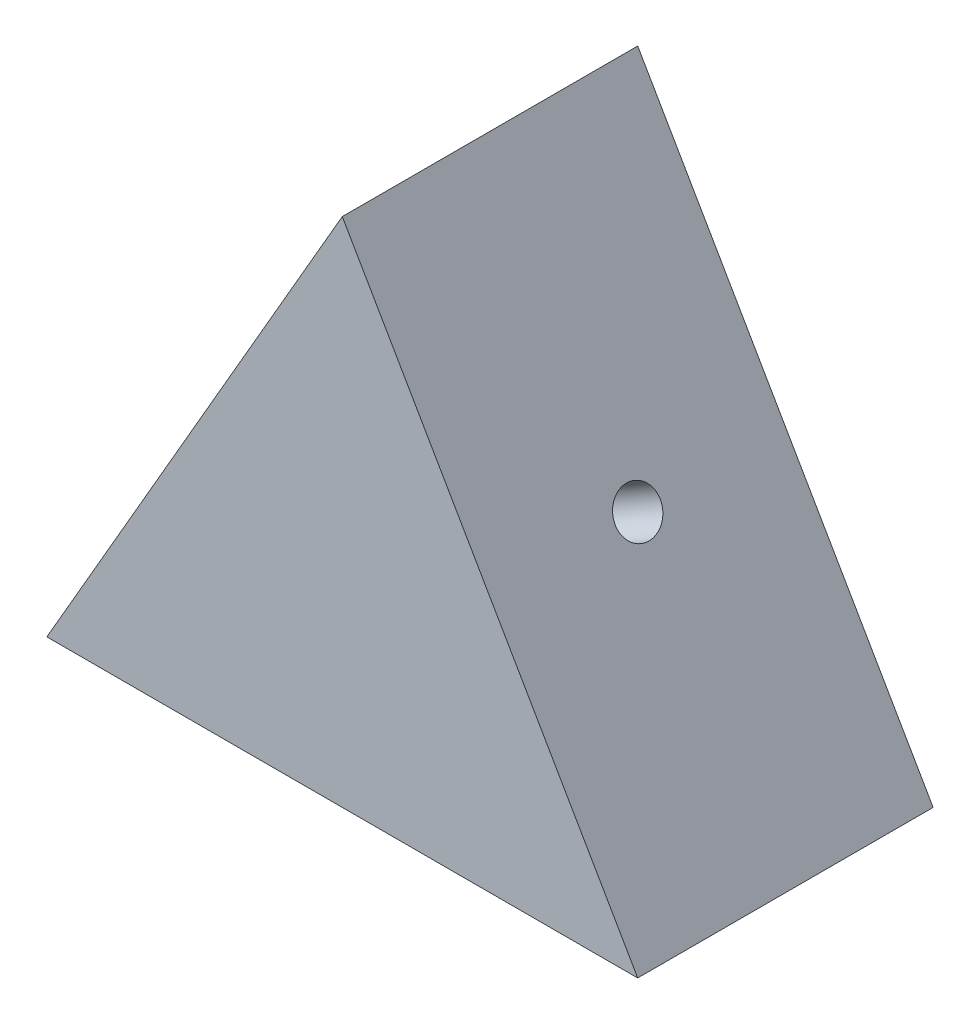
ISO-10303-21;
HEADER;
FILE_DESCRIPTION(('STEP AP214'),'2;1');
FILE_NAME('part.step','',(''),(''),'','','');
FILE_SCHEMA(('AUTOMOTIVE_DESIGN { 1 0 10303 214 1 1 1 1 }'));
ENDSEC;
DATA;
#1=APPLICATION_CONTEXT('core data for automotive mechanical design processes');
#2=APPLICATION_PROTOCOL_DEFINITION('international standard','automotive_design',2000,#1);
#3=PRODUCT_CONTEXT('',#1,'mechanical');
#4=PRODUCT('Part','Part','',(#3));
#5=PRODUCT_RELATED_PRODUCT_CATEGORY('part','',(#4));
#6=PRODUCT_DEFINITION_FORMATION('','',#4);
#7=PRODUCT_DEFINITION_CONTEXT('part definition',#1,'design');
#8=PRODUCT_DEFINITION('design','',#6,#7);
#9=PRODUCT_DEFINITION_SHAPE('','',#8);
#10=(LENGTH_UNIT() NAMED_UNIT(*) SI_UNIT(.MILLI.,.METRE.));
#11=(NAMED_UNIT(*) PLANE_ANGLE_UNIT() SI_UNIT($,.RADIAN.));
#12=(NAMED_UNIT(*) SI_UNIT($,.STERADIAN.) SOLID_ANGLE_UNIT());
#13=UNCERTAINTY_MEASURE_WITH_UNIT(LENGTH_MEASURE(1.E-05),#10,'distance_accuracy_value','');
#14=(GEOMETRIC_REPRESENTATION_CONTEXT(3) GLOBAL_UNCERTAINTY_ASSIGNED_CONTEXT((#13)) GLOBAL_UNIT_ASSIGNED_CONTEXT((#10,
#11,#12)) REPRESENTATION_CONTEXT('',''));
#15=CARTESIAN_POINT('',(0.,0.,0.));
#16=DIRECTION('',(0.,0.,1.));
#17=DIRECTION('',(1.,0.,0.));
#18=AXIS2_PLACEMENT_3D('',#15,#16,#17);
#19=CARTESIAN_POINT('',(0.,0.,250.));
#20=DIRECTION('',(0.,1.,0.));
#21=DIRECTION('',(0.,0.,1.));
#22=AXIS2_PLACEMENT_3D('',#19,#20,#21);
#23=PLANE('',#22);
#24=CARTESIAN_POINT('',(-1.11022302462516E-13,0.,125.));
#25=DIRECTION('',(0.,-1.,0.));
#26=DIRECTION('',(0.,0.,-1.));
#27=AXIS2_PLACEMENT_3D('',#24,#25,#26);
#28=CIRCLE('',#27,19.05);
#29=CARTESIAN_POINT('',(-1.11022302462516E-13,0.,105.95));
#30=VERTEX_POINT('',#29);
#31=EDGE_CURVE('E129',#30,#30,#28,.T.);
#32=ORIENTED_EDGE('',*,*,#31,.F.);
#33=EDGE_LOOP('',(#32));
#34=FACE_BOUND('',#33,.T.);
#35=DIRECTION('',(1.,0.,0.));
#36=VECTOR('',#35,1.);
#37=CARTESIAN_POINT('',(0.,0.,0.));
#38=LINE('',#37,#36);
#39=CARTESIAN_POINT('',(-250.,0.,0.));
#40=VERTEX_POINT('',#39);
#41=CARTESIAN_POINT('',(250.,0.,0.));
#42=VERTEX_POINT('',#41);
#43=EDGE_CURVE('E77',#40,#42,#38,.T.);
#44=ORIENTED_EDGE('',*,*,#43,.T.);
#45=DIRECTION('',(0.,0.,-1.));
#46=VECTOR('',#45,1.);
#47=CARTESIAN_POINT('',(250.,0.,250.));
#48=LINE('',#47,#46);
#49=CARTESIAN_POINT('',(250.,0.,250.));
#50=VERTEX_POINT('',#49);
#51=EDGE_CURVE('E11',#50,#42,#48,.T.);
#52=ORIENTED_EDGE('',*,*,#51,.F.);
#53=DIRECTION('',(-1.,0.,0.));
#54=VECTOR('',#53,1.);
#55=CARTESIAN_POINT('',(0.,0.,250.));
#56=LINE('',#55,#54);
#57=CARTESIAN_POINT('',(-250.,0.,250.));
#58=VERTEX_POINT('',#57);
#59=EDGE_CURVE('E59',#50,#58,#56,.T.);
#60=ORIENTED_EDGE('',*,*,#59,.T.);
#61=DIRECTION('',(0.,0.,-1.));
#62=VECTOR('',#61,1.);
#63=CARTESIAN_POINT('',(-250.,0.,250.));
#64=LINE('',#63,#62);
#65=EDGE_CURVE('E43',#58,#40,#64,.T.);
#66=ORIENTED_EDGE('',*,*,#65,.T.);
#67=EDGE_LOOP('',(#44,#52,#60,#66));
#68=FACE_BOUND('',#67,.T.);
#69=ADVANCED_FACE('F39',(#34,#68),#23,.F.);
#70=CARTESIAN_POINT('',(250.,0.,250.));
#71=DIRECTION('',(-0.866025403784439,-0.5,0.));
#72=DIRECTION('',(0.5,-0.866025403784439,0.));
#73=AXIS2_PLACEMENT_3D('',#70,#71,#72);
#74=PLANE('',#73);
#75=CARTESIAN_POINT('',(125.,216.50635094611,125.));
#76=DIRECTION('',(0.866025403784439,0.5,0.));
#77=DIRECTION('',(-0.5,0.866025403784439,0.));
#78=AXIS2_PLACEMENT_3D('',#75,#76,#77);
#79=CIRCLE('',#78,19.05);
#80=CARTESIAN_POINT('',(115.475,233.004134888203,125.));
#81=VERTEX_POINT('',#80);
#82=EDGE_CURVE('E94',#81,#81,#79,.T.);
#83=ORIENTED_EDGE('',*,*,#82,.F.);
#84=EDGE_LOOP('',(#83));
#85=FACE_BOUND('',#84,.T.);
#86=DIRECTION('',(-0.5,0.866025403784439,0.));
#87=VECTOR('',#86,1.);
#88=CARTESIAN_POINT('',(250.,0.,0.));
#89=LINE('',#88,#87);
#90=CARTESIAN_POINT('',(0.,433.012701892219,0.));
#91=VERTEX_POINT('',#90);
#92=EDGE_CURVE('E91',#42,#91,#89,.T.);
#93=ORIENTED_EDGE('',*,*,#92,.T.);
#94=DIRECTION('',(0.,0.,-1.));
#95=VECTOR('',#94,1.);
#96=CARTESIAN_POINT('',(0.,433.012701892219,250.));
#97=LINE('',#96,#95);
#98=CARTESIAN_POINT('',(0.,433.012701892219,250.));
#99=VERTEX_POINT('',#98);
#100=EDGE_CURVE('E50',#99,#91,#97,.T.);
#101=ORIENTED_EDGE('',*,*,#100,.F.);
#102=DIRECTION('',(-0.5,0.866025403784439,0.));
#103=VECTOR('',#102,1.);
#104=CARTESIAN_POINT('',(250.,0.,250.));
#105=LINE('',#104,#103);
#106=EDGE_CURVE('E83',#50,#99,#105,.T.);
#107=ORIENTED_EDGE('',*,*,#106,.F.);
#108=ORIENTED_EDGE('',*,*,#51,.T.);
#109=EDGE_LOOP('',(#93,#101,#107,#108));
#110=FACE_BOUND('',#109,.T.);
#111=ADVANCED_FACE('F106',(#85,#110),#74,.F.);
#112=CARTESIAN_POINT('',(-250.,0.,250.));
#113=DIRECTION('',(-0.866025403784439,0.5,0.));
#114=DIRECTION('',(-0.5,-0.866025403784438,0.));
#115=AXIS2_PLACEMENT_3D('',#112,#113,#114);
#116=PLANE('',#115);
#117=CARTESIAN_POINT('',(-125.,216.50635094611,125.));
#118=DIRECTION('',(-0.866025403784439,0.5,0.));
#119=DIRECTION('',(-0.5,-0.866025403784439,0.));
#120=AXIS2_PLACEMENT_3D('',#117,#118,#119);
#121=CIRCLE('',#120,19.05);
#122=CARTESIAN_POINT('',(-134.525,200.008567004016,125.));
#123=VERTEX_POINT('',#122);
#124=EDGE_CURVE('E140',#123,#123,#121,.T.);
#125=ORIENTED_EDGE('',*,*,#124,.F.);
#126=EDGE_LOOP('',(#125));
#127=FACE_BOUND('',#126,.T.);
#128=DIRECTION('',(0.5,0.866025403784438,0.));
#129=VECTOR('',#128,1.);
#130=CARTESIAN_POINT('',(-250.,0.,0.));
#131=LINE('',#130,#129);
#132=EDGE_CURVE('E81',#40,#91,#131,.T.);
#133=ORIENTED_EDGE('',*,*,#132,.F.);
#134=ORIENTED_EDGE('',*,*,#65,.F.);
#135=DIRECTION('',(0.5,0.866025403784438,0.));
#136=VECTOR('',#135,1.);
#137=CARTESIAN_POINT('',(-250.,0.,250.));
#138=LINE('',#137,#136);
#139=EDGE_CURVE('E79',#58,#99,#138,.T.);
#140=ORIENTED_EDGE('',*,*,#139,.T.);
#141=ORIENTED_EDGE('',*,*,#100,.T.);
#142=EDGE_LOOP('',(#133,#134,#140,#141));
#143=FACE_BOUND('',#142,.T.);
#144=ADVANCED_FACE('F41',(#127,#143),#116,.T.);
#145=CARTESIAN_POINT('',(0.,0.,250.));
#146=DIRECTION('',(0.,0.,-1.));
#147=DIRECTION('',(-1.,0.,0.));
#148=AXIS2_PLACEMENT_3D('',#145,#146,#147);
#149=PLANE('',#148);
#150=ORIENTED_EDGE('',*,*,#59,.F.);
#151=ORIENTED_EDGE('',*,*,#106,.T.);
#152=ORIENTED_EDGE('',*,*,#139,.F.);
#153=EDGE_LOOP('',(#150,#151,#152));
#154=FACE_BOUND('',#153,.T.);
#155=ADVANCED_FACE('F84',(#154),#149,.F.);
#156=CARTESIAN_POINT('',(0.,0.,0.));
#157=DIRECTION('',(0.,0.,-1.));
#158=DIRECTION('',(-1.,0.,0.));
#159=AXIS2_PLACEMENT_3D('',#156,#157,#158);
#160=PLANE('',#159);
#161=ORIENTED_EDGE('',*,*,#43,.F.);
#162=ORIENTED_EDGE('',*,*,#132,.T.);
#163=ORIENTED_EDGE('',*,*,#92,.F.);
#164=EDGE_LOOP('',(#161,#162,#163));
#165=FACE_BOUND('',#164,.T.);
#166=ADVANCED_FACE('F108',(#165),#160,.T.);
#167=CARTESIAN_POINT('',(59.0088642316258,178.40635094611,125.));
#168=DIRECTION('',(0.866025403784439,0.5,0.));
#169=DIRECTION('',(-0.5,0.866025403784439,0.));
#170=AXIS2_PLACEMENT_3D('',#167,#168,#169);
#171=CYLINDRICAL_SURFACE('',#170,19.05);
#172=CARTESIAN_POINT('',(59.0088642316258,178.40635094611,125.));
#173=DIRECTION('',(0.866025403784439,0.5,0.));
#174=DIRECTION('',(-0.5,0.866025403784439,0.));
#175=AXIS2_PLACEMENT_3D('',#172,#173,#174);
#176=CIRCLE('',#175,19.05);
#177=CARTESIAN_POINT('',(49.4838642316258,194.904134888203,125.));
#178=VERTEX_POINT('',#177);
#179=EDGE_CURVE('E101',#178,#178,#176,.T.);
#180=ORIENTED_EDGE('',*,*,#179,.F.);
#181=EDGE_LOOP('',(#180));
#182=FACE_BOUND('',#181,.T.);
#183=ORIENTED_EDGE('',*,*,#82,.T.);
#184=EDGE_LOOP('',(#183));
#185=FACE_BOUND('',#184,.T.);
#186=ADVANCED_FACE('F110',(#182,#185),#171,.F.);
#187=CARTESIAN_POINT('',(59.0088642316258,178.40635094611,125.));
#188=DIRECTION('',(0.866025403784439,0.5,0.));
#189=DIRECTION('',(-0.5,0.866025403784439,0.));
#190=AXIS2_PLACEMENT_3D('',#187,#188,#189);
#191=PLANE('',#190);
#192=ORIENTED_EDGE('',*,*,#179,.T.);
#193=EDGE_LOOP('',(#192));
#194=FACE_BOUND('',#193,.T.);
#195=ADVANCED_FACE('F116',(#194),#191,.T.);
#196=CARTESIAN_POINT('',(-1.11022302462516E-13,76.2,125.));
#197=DIRECTION('',(0.,-1.,0.));
#198=DIRECTION('',(0.,0.,-1.));
#199=AXIS2_PLACEMENT_3D('',#196,#197,#198);
#200=CYLINDRICAL_SURFACE('',#199,19.05);
#201=CARTESIAN_POINT('',(-1.11022302462516E-13,76.2,125.));
#202=DIRECTION('',(0.,-1.,0.));
#203=DIRECTION('',(0.,0.,-1.));
#204=AXIS2_PLACEMENT_3D('',#201,#202,#203);
#205=CIRCLE('',#204,19.05);
#206=CARTESIAN_POINT('',(-1.11022302462516E-13,76.2,105.95));
#207=VERTEX_POINT('',#206);
#208=EDGE_CURVE('E132',#207,#207,#205,.T.);
#209=ORIENTED_EDGE('',*,*,#208,.F.);
#210=EDGE_LOOP('',(#209));
#211=FACE_BOUND('',#210,.T.);
#212=ORIENTED_EDGE('',*,*,#31,.T.);
#213=EDGE_LOOP('',(#212));
#214=FACE_BOUND('',#213,.T.);
#215=ADVANCED_FACE('F152',(#211,#214),#200,.F.);
#216=CARTESIAN_POINT('',(-1.11022302462516E-13,76.2,125.));
#217=DIRECTION('',(0.,-1.,0.));
#218=DIRECTION('',(0.,0.,-1.));
#219=AXIS2_PLACEMENT_3D('',#216,#217,#218);
#220=PLANE('',#219);
#221=ORIENTED_EDGE('',*,*,#208,.T.);
#222=EDGE_LOOP('',(#221));
#223=FACE_BOUND('',#222,.T.);
#224=ADVANCED_FACE('F157',(#223),#220,.T.);
#225=CARTESIAN_POINT('',(-59.0088642316259,178.40635094611,125.));
#226=DIRECTION('',(-0.866025403784438,0.5,0.));
#227=DIRECTION('',(-0.5,-0.866025403784438,0.));
#228=AXIS2_PLACEMENT_3D('',#225,#226,#227);
#229=CYLINDRICAL_SURFACE('',#228,19.05);
#230=CARTESIAN_POINT('',(-59.0088642316259,178.40635094611,125.));
#231=DIRECTION('',(-0.866025403784439,0.5,0.));
#232=DIRECTION('',(-0.5,-0.866025403784439,0.));
#233=AXIS2_PLACEMENT_3D('',#230,#231,#232);
#234=CIRCLE('',#233,19.05);
#235=CARTESIAN_POINT('',(-68.5338642316259,161.908567004016,125.));
#236=VERTEX_POINT('',#235);
#237=EDGE_CURVE('E133',#236,#236,#234,.T.);
#238=ORIENTED_EDGE('',*,*,#237,.F.);
#239=EDGE_LOOP('',(#238));
#240=FACE_BOUND('',#239,.T.);
#241=ORIENTED_EDGE('',*,*,#124,.T.);
#242=EDGE_LOOP('',(#241));
#243=FACE_BOUND('',#242,.T.);
#244=ADVANCED_FACE('F163',(#240,#243),#229,.F.);
#245=CARTESIAN_POINT('',(-59.0088642316259,178.40635094611,125.));
#246=DIRECTION('',(-0.866025403784439,0.5,0.));
#247=DIRECTION('',(-0.5,-0.866025403784439,0.));
#248=AXIS2_PLACEMENT_3D('',#245,#246,#247);
#249=PLANE('',#248);
#250=ORIENTED_EDGE('',*,*,#237,.T.);
#251=EDGE_LOOP('',(#250));
#252=FACE_BOUND('',#251,.T.);
#253=ADVANCED_FACE('F167',(#252),#249,.T.);
#254=CLOSED_SHELL('',(#69,#111,#144,#155,#166,#186,#195,#215,#224,#244,#253));
#255=MANIFOLD_SOLID_BREP('B2',#254);
#256=ADVANCED_BREP_SHAPE_REPRESENTATION('',(#18,#255),#14);
#257=SHAPE_DEFINITION_REPRESENTATION(#9,#256);
ENDSEC;
END-ISO-10303-21;
